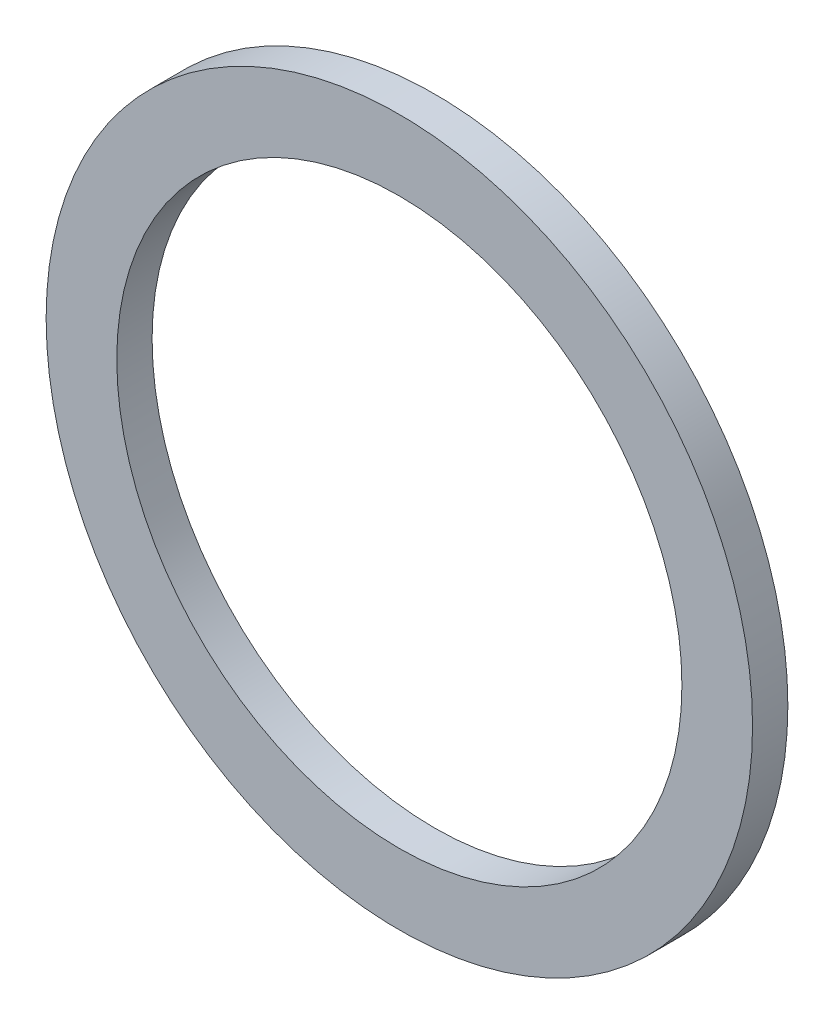
ISO-10303-21;
HEADER;
FILE_DESCRIPTION(('STEP AP214'),'2;1');
FILE_NAME('part.step','',(''),(''),'','','');
FILE_SCHEMA(('AUTOMOTIVE_DESIGN { 1 0 10303 214 1 1 1 1 }'));
ENDSEC;
DATA;
#1=APPLICATION_CONTEXT('core data for automotive mechanical design processes');
#2=APPLICATION_PROTOCOL_DEFINITION('international standard','automotive_design',2000,#1);
#3=PRODUCT_CONTEXT('',#1,'mechanical');
#4=PRODUCT('Part','Part','',(#3));
#5=PRODUCT_RELATED_PRODUCT_CATEGORY('part','',(#4));
#6=PRODUCT_DEFINITION_FORMATION('','',#4);
#7=PRODUCT_DEFINITION_CONTEXT('part definition',#1,'design');
#8=PRODUCT_DEFINITION('design','',#6,#7);
#9=PRODUCT_DEFINITION_SHAPE('','',#8);
#10=(LENGTH_UNIT() NAMED_UNIT(*) SI_UNIT(.MILLI.,.METRE.));
#11=(NAMED_UNIT(*) PLANE_ANGLE_UNIT() SI_UNIT($,.RADIAN.));
#12=(NAMED_UNIT(*) SI_UNIT($,.STERADIAN.) SOLID_ANGLE_UNIT());
#13=UNCERTAINTY_MEASURE_WITH_UNIT(LENGTH_MEASURE(1.E-05),#10,'distance_accuracy_value','');
#14=(GEOMETRIC_REPRESENTATION_CONTEXT(3) GLOBAL_UNCERTAINTY_ASSIGNED_CONTEXT((#13)) GLOBAL_UNIT_ASSIGNED_CONTEXT((#10,
#11,#12)) REPRESENTATION_CONTEXT('',''));
#15=CARTESIAN_POINT('',(0.,0.,0.));
#16=DIRECTION('',(0.,0.,1.));
#17=DIRECTION('',(1.,0.,0.));
#18=AXIS2_PLACEMENT_3D('',#15,#16,#17);
#19=CARTESIAN_POINT('',(-8.00000011920929,-4.33333336313566,2.));
#20=DIRECTION('',(0.,0.,1.));
#21=DIRECTION('',(1.,0.,0.));
#22=AXIS2_PLACEMENT_3D('',#19,#20,#21);
#23=PLANE('',#22);
#24=CARTESIAN_POINT('',(-8.00000011920929,-4.33333336313566,2.));
#25=DIRECTION('',(0.,0.,-1.));
#26=DIRECTION('',(-1.,0.,0.));
#27=AXIS2_PLACEMENT_3D('',#24,#25,#26);
#28=CIRCLE('',#27,0.800000014901161);
#29=CARTESIAN_POINT('',(-7.20000010430813,-4.33333336313566,2.));
#30=VERTEX_POINT('',#29);
#31=EDGE_CURVE('E60',#30,#30,#28,.T.);
#32=ORIENTED_EDGE('',*,*,#31,.F.);
#33=EDGE_LOOP('',(#32));
#34=FACE_BOUND('',#33,.T.);
#35=CARTESIAN_POINT('',(-8.00000011920929,-4.33333336313566,2.));
#36=DIRECTION('',(0.,0.,1.));
#37=DIRECTION('',(-1.,0.,0.));
#38=AXIS2_PLACEMENT_3D('',#35,#36,#37);
#39=CIRCLE('',#38,1.00000001490116);
#40=CARTESIAN_POINT('',(-7.00000010430813,-4.33333336313566,2.));
#41=VERTEX_POINT('',#40);
#42=EDGE_CURVE('E11',#41,#41,#39,.T.);
#43=ORIENTED_EDGE('',*,*,#42,.F.);
#44=EDGE_LOOP('',(#43));
#45=FACE_BOUND('',#44,.T.);
#46=ADVANCED_FACE('F17',(#34,#45),#23,.F.);
#47=CARTESIAN_POINT('',(-8.00000011920929,-4.33333336313566,2.1));
#48=DIRECTION('',(0.,0.,1.));
#49=DIRECTION('',(1.,0.,0.));
#50=AXIS2_PLACEMENT_3D('',#47,#48,#49);
#51=PLANE('',#50);
#52=CARTESIAN_POINT('',(-8.00000011920929,-4.33333336313566,2.1));
#53=DIRECTION('',(0.,0.,-1.));
#54=DIRECTION('',(-1.,0.,0.));
#55=AXIS2_PLACEMENT_3D('',#52,#53,#54);
#56=CIRCLE('',#55,0.800000014901161);
#57=CARTESIAN_POINT('',(-7.20000010430813,-4.33333336313566,2.1));
#58=VERTEX_POINT('',#57);
#59=EDGE_CURVE('E58',#58,#58,#56,.T.);
#60=ORIENTED_EDGE('',*,*,#59,.T.);
#61=EDGE_LOOP('',(#60));
#62=FACE_BOUND('',#61,.T.);
#63=CARTESIAN_POINT('',(-8.00000011920929,-4.33333336313566,2.1));
#64=DIRECTION('',(0.,0.,1.));
#65=DIRECTION('',(-1.,0.,0.));
#66=AXIS2_PLACEMENT_3D('',#63,#64,#65);
#67=CIRCLE('',#66,1.00000001490116);
#68=CARTESIAN_POINT('',(-7.00000010430813,-4.33333336313566,2.1));
#69=VERTEX_POINT('',#68);
#70=EDGE_CURVE('E21',#69,#69,#67,.T.);
#71=ORIENTED_EDGE('',*,*,#70,.T.);
#72=EDGE_LOOP('',(#71));
#73=FACE_BOUND('',#72,.T.);
#74=ADVANCED_FACE('F19',(#62,#73),#51,.T.);
#75=CARTESIAN_POINT('',(-8.00000011920929,-4.33333336313566,2.));
#76=DIRECTION('',(0.,0.,1.));
#77=DIRECTION('',(-1.,0.,0.));
#78=AXIS2_PLACEMENT_3D('',#75,#76,#77);
#79=CYLINDRICAL_SURFACE('',#78,1.00000001490116);
#80=ORIENTED_EDGE('',*,*,#70,.F.);
#81=DIRECTION('',(0.,0.,-1.));
#82=VECTOR('',#81,1.);
#83=CARTESIAN_POINT('',(-7.00000010430813,-4.33333336313566,2.));
#84=LINE('',#83,#82);
#85=EDGE_CURVE('E27',#69,#41,#84,.T.);
#86=ORIENTED_EDGE('',*,*,#85,.T.);
#87=ORIENTED_EDGE('',*,*,#42,.T.);
#88=ORIENTED_EDGE('',*,*,#85,.F.);
#89=EDGE_LOOP('',(#80,#86,#87,#88));
#90=FACE_BOUND('',#89,.T.);
#91=ADVANCED_FACE('F75',(#90),#79,.T.);
#92=CARTESIAN_POINT('',(-8.00000011920929,-4.33333336313566,2.));
#93=DIRECTION('',(0.,0.,1.));
#94=DIRECTION('',(-1.,0.,0.));
#95=AXIS2_PLACEMENT_3D('',#92,#93,#94);
#96=CYLINDRICAL_SURFACE('',#95,0.800000014901161);
#97=ORIENTED_EDGE('',*,*,#59,.F.);
#98=DIRECTION('',(0.,0.,-1.));
#99=VECTOR('',#98,1.);
#100=CARTESIAN_POINT('',(-7.20000010430813,-4.33333336313566,2.));
#101=LINE('',#100,#99);
#102=EDGE_CURVE('E55',#58,#30,#101,.T.);
#103=ORIENTED_EDGE('',*,*,#102,.T.);
#104=ORIENTED_EDGE('',*,*,#31,.T.);
#105=ORIENTED_EDGE('',*,*,#102,.F.);
#106=EDGE_LOOP('',(#97,#103,#104,#105));
#107=FACE_BOUND('',#106,.T.);
#108=ADVANCED_FACE('F57',(#107),#96,.F.);
#109=CLOSED_SHELL('',(#46,#74,#91,#108));
#110=MANIFOLD_SOLID_BREP('B1',#109);
#111=ADVANCED_BREP_SHAPE_REPRESENTATION('',(#18,#110),#14);
#112=SHAPE_DEFINITION_REPRESENTATION(#9,#111);
ENDSEC;
END-ISO-10303-21;
